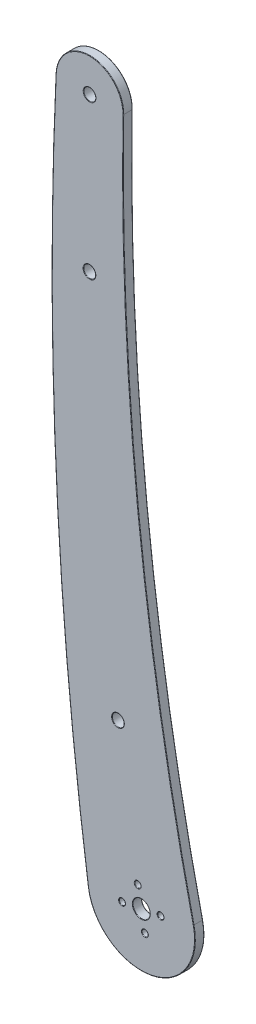
ISO-10303-21;
HEADER;
FILE_DESCRIPTION(('STEP AP214'),'2;1');
FILE_NAME('part.step','',(''),(''),'','','');
FILE_SCHEMA(('AUTOMOTIVE_DESIGN { 1 0 10303 214 1 1 1 1 }'));
ENDSEC;
DATA;
#1=APPLICATION_CONTEXT('core data for automotive mechanical design processes');
#2=APPLICATION_PROTOCOL_DEFINITION('international standard','automotive_design',2000,#1);
#3=PRODUCT_CONTEXT('',#1,'mechanical');
#4=PRODUCT('Part','Part','',(#3));
#5=PRODUCT_RELATED_PRODUCT_CATEGORY('part','',(#4));
#6=PRODUCT_DEFINITION_FORMATION('','',#4);
#7=PRODUCT_DEFINITION_CONTEXT('part definition',#1,'design');
#8=PRODUCT_DEFINITION('design','',#6,#7);
#9=PRODUCT_DEFINITION_SHAPE('','',#8);
#10=(LENGTH_UNIT() NAMED_UNIT(*) SI_UNIT(.MILLI.,.METRE.));
#11=(NAMED_UNIT(*) PLANE_ANGLE_UNIT() SI_UNIT($,.RADIAN.));
#12=(NAMED_UNIT(*) SI_UNIT($,.STERADIAN.) SOLID_ANGLE_UNIT());
#13=UNCERTAINTY_MEASURE_WITH_UNIT(LENGTH_MEASURE(1.E-05),#10,'distance_accuracy_value','');
#14=(GEOMETRIC_REPRESENTATION_CONTEXT(3) GLOBAL_UNCERTAINTY_ASSIGNED_CONTEXT((#13)) GLOBAL_UNIT_ASSIGNED_CONTEXT((#10,
#11,#12)) REPRESENTATION_CONTEXT('',''));
#15=CARTESIAN_POINT('',(0.,0.,0.));
#16=DIRECTION('',(0.,0.,1.));
#17=DIRECTION('',(1.,0.,0.));
#18=AXIS2_PLACEMENT_3D('',#15,#16,#17);
#19=CARTESIAN_POINT('',(-37.0776547455483,278.939028450343,-3.));
#20=DIRECTION('',(0.,0.,1.));
#21=DIRECTION('',(1.,0.,0.));
#22=AXIS2_PLACEMENT_3D('',#19,#20,#21);
#23=CYLINDRICAL_SURFACE('',#22,11.0000000000001);
#24=DIRECTION('',(0.,0.,1.));
#25=VECTOR('',#24,1.);
#26=CARTESIAN_POINT('',(-26.0791673880019,278.756611768298,-3.));
#27=LINE('',#26,#25);
#28=CARTESIAN_POINT('',(-26.0791673880019,278.756611768298,-2.85));
#29=VERTEX_POINT('',#28);
#30=CARTESIAN_POINT('',(-26.0791673880019,278.756611768298,-0.15));
#31=VERTEX_POINT('',#30);
#32=EDGE_CURVE('E108',#29,#31,#27,.T.);
#33=ORIENTED_EDGE('',*,*,#32,.F.);
#34=CARTESIAN_POINT('',(-37.0776547455483,278.939028450343,-2.85));
#35=DIRECTION('',(0.,0.,-1.));
#36=DIRECTION('',(-1.,0.,0.));
#37=AXIS2_PLACEMENT_3D('',#34,#35,#36);
#38=CIRCLE('',#37,11.0000000000001);
#39=CARTESIAN_POINT('',(-48.0655821267615,279.45424866073,-2.85));
#40=VERTEX_POINT('',#39);
#41=EDGE_CURVE('E103',#29,#40,#38,.F.);
#42=ORIENTED_EDGE('',*,*,#41,.T.);
#43=DIRECTION('',(0.,0.,1.));
#44=VECTOR('',#43,1.);
#45=CARTESIAN_POINT('',(-48.0655821267615,279.45424866073,-3.));
#46=LINE('',#45,#44);
#47=CARTESIAN_POINT('',(-48.0655821267615,279.45424866073,-0.15));
#48=VERTEX_POINT('',#47);
#49=EDGE_CURVE('E105',#40,#48,#46,.T.);
#50=ORIENTED_EDGE('',*,*,#49,.T.);
#51=CARTESIAN_POINT('',(-37.0776547455483,278.939028450343,-0.15));
#52=DIRECTION('',(0.,0.,-1.));
#53=DIRECTION('',(-1.,0.,0.));
#54=AXIS2_PLACEMENT_3D('',#51,#52,#53);
#55=CIRCLE('',#54,11.0000000000001);
#56=EDGE_CURVE('E114',#48,#31,#55,.T.);
#57=ORIENTED_EDGE('',*,*,#56,.T.);
#58=EDGE_LOOP('',(#33,#42,#50,#57));
#59=FACE_BOUND('',#58,.T.);
#60=ADVANCED_FACE('F37',(#59),#23,.T.);
#61=CARTESIAN_POINT('',(873.797070956716,263.831610510011,-3.));
#62=DIRECTION('',(0.,0.,1.));
#63=DIRECTION('',(1.,0.,0.));
#64=AXIS2_PLACEMENT_3D('',#61,#62,#63);
#65=CYLINDRICAL_SURFACE('',#64,900.);
#66=DIRECTION('',(0.,0.,1.));
#67=VECTOR('',#66,1.);
#68=CARTESIAN_POINT('',(-3.16790327875482,61.5139544238968,-3.));
#69=LINE('',#68,#67);
#70=CARTESIAN_POINT('',(-3.16790327875482,61.5139544238968,-2.85));
#71=VERTEX_POINT('',#70);
#72=CARTESIAN_POINT('',(-3.16790327875482,61.5139544238968,-0.15));
#73=VERTEX_POINT('',#72);
#74=EDGE_CURVE('E286',#71,#73,#69,.T.);
#75=ORIENTED_EDGE('',*,*,#74,.F.);
#76=CARTESIAN_POINT('',(873.797070956716,263.831610510011,-2.85));
#77=DIRECTION('',(0.,0.,-1.));
#78=DIRECTION('',(-1.,0.,0.));
#79=AXIS2_PLACEMENT_3D('',#76,#77,#78);
#80=CIRCLE('',#79,900.);
#81=EDGE_CURVE('E182',#71,#29,#80,.T.);
#82=ORIENTED_EDGE('',*,*,#81,.T.);
#83=ORIENTED_EDGE('',*,*,#32,.T.);
#84=CARTESIAN_POINT('',(873.797070956716,263.831610510011,-0.15));
#85=DIRECTION('',(0.,0.,-1.));
#86=DIRECTION('',(-1.,0.,0.));
#87=AXIS2_PLACEMENT_3D('',#84,#85,#86);
#88=CIRCLE('',#87,900.);
#89=EDGE_CURVE('E179',#31,#73,#88,.F.);
#90=ORIENTED_EDGE('',*,*,#89,.T.);
#91=EDGE_LOOP('',(#75,#82,#83,#90));
#92=FACE_BOUND('',#91,.T.);
#93=ADVANCED_FACE('F283',(#92),#65,.F.);
#94=CARTESIAN_POINT('',(-20.2199999999997,57.58,-3.));
#95=DIRECTION('',(0.,0.,1.));
#96=DIRECTION('',(1.,0.,0.));
#97=AXIS2_PLACEMENT_3D('',#94,#95,#96);
#98=CYLINDRICAL_SURFACE('',#97,17.4999999999997);
#99=DIRECTION('',(0.,0.,1.));
#100=VECTOR('',#99,1.);
#101=CARTESIAN_POINT('',(-37.5474034553959,55.1282476687248,-3.));
#102=LINE('',#101,#100);
#103=CARTESIAN_POINT('',(-37.5474034553959,55.1282476687248,-2.85));
#104=VERTEX_POINT('',#103);
#105=CARTESIAN_POINT('',(-37.5474034553959,55.1282476687248,-0.15));
#106=VERTEX_POINT('',#105);
#107=EDGE_CURVE('E125',#104,#106,#102,.T.);
#108=ORIENTED_EDGE('',*,*,#107,.F.);
#109=CARTESIAN_POINT('',(-20.2199999999997,57.58,-2.85));
#110=DIRECTION('',(0.,0.,-1.));
#111=DIRECTION('',(-1.,0.,0.));
#112=AXIS2_PLACEMENT_3D('',#109,#110,#111);
#113=CIRCLE('',#112,17.4999999999997);
#114=EDGE_CURVE('E177',#104,#71,#113,.F.);
#115=ORIENTED_EDGE('',*,*,#114,.T.);
#116=ORIENTED_EDGE('',*,*,#74,.T.);
#117=CARTESIAN_POINT('',(-20.2199999999997,57.58,-0.15));
#118=DIRECTION('',(0.,0.,-1.));
#119=DIRECTION('',(-1.,0.,0.));
#120=AXIS2_PLACEMENT_3D('',#117,#118,#119);
#121=CIRCLE('',#120,17.4999999999997);
#122=EDGE_CURVE('E175',#73,#106,#121,.T.);
#123=ORIENTED_EDGE('',*,*,#122,.T.);
#124=EDGE_LOOP('',(#108,#115,#116,#123));
#125=FACE_BOUND('',#124,.T.);
#126=ADVANCED_FACE('F338',(#125),#98,.T.);
#127=CARTESIAN_POINT('',(1150.61740491465,223.248407527602,-3.));
#128=DIRECTION('',(0.,0.,1.));
#129=DIRECTION('',(1.,0.,0.));
#130=AXIS2_PLACEMENT_3D('',#127,#128,#129);
#131=CYLINDRICAL_SURFACE('',#130,1200.);
#132=ORIENTED_EDGE('',*,*,#49,.F.);
#133=CARTESIAN_POINT('',(1150.61740491465,223.248407527602,-2.85));
#134=DIRECTION('',(0.,0.,-1.));
#135=DIRECTION('',(-1.,0.,0.));
#136=AXIS2_PLACEMENT_3D('',#133,#134,#135);
#137=CIRCLE('',#136,1200.);
#138=EDGE_CURVE('E121',#40,#104,#137,.F.);
#139=ORIENTED_EDGE('',*,*,#138,.T.);
#140=ORIENTED_EDGE('',*,*,#107,.T.);
#141=CARTESIAN_POINT('',(1150.61740491465,223.248407527602,-0.15));
#142=DIRECTION('',(0.,0.,-1.));
#143=DIRECTION('',(-1.,0.,0.));
#144=AXIS2_PLACEMENT_3D('',#141,#142,#143);
#145=CIRCLE('',#144,1200.);
#146=EDGE_CURVE('E124',#106,#48,#145,.T.);
#147=ORIENTED_EDGE('',*,*,#146,.T.);
#148=EDGE_LOOP('',(#132,#139,#140,#147));
#149=FACE_BOUND('',#148,.T.);
#150=ADVANCED_FACE('F118',(#149),#131,.T.);
#151=CARTESIAN_POINT('',(418.359708105584,271.385319480177,-3.));
#152=DIRECTION('',(0.,0.,-1.));
#153=DIRECTION('',(-1.,0.,0.));
#154=AXIS2_PLACEMENT_3D('',#151,#152,#153);
#155=PLANE('',#154);
#156=CARTESIAN_POINT('',(-20.2199999999997,57.58,-3.));
#157=DIRECTION('',(0.,0.,-1.));
#158=DIRECTION('',(-1.,0.,0.));
#159=AXIS2_PLACEMENT_3D('',#156,#157,#158);
#160=CIRCLE('',#159,17.3499999999997);
#161=CARTESIAN_POINT('',(-3.31406410779405,61.4802348145491,-3.));
#162=VERTEX_POINT('',#161);
#163=CARTESIAN_POINT('',(-37.3988828543496,55.1492626887071,-3.));
#164=VERTEX_POINT('',#163);
#165=EDGE_CURVE('E171',#162,#164,#160,.T.);
#166=ORIENTED_EDGE('',*,*,#165,.T.);
#167=CARTESIAN_POINT('',(1150.61740491465,223.248407527602,-3.));
#168=DIRECTION('',(0.,0.,-1.));
#169=DIRECTION('',(-1.,0.,0.));
#170=AXIS2_PLACEMENT_3D('',#167,#168,#169);
#171=CIRCLE('',#170,1199.85);
#172=CARTESIAN_POINT('',(-47.9157467533811,279.447222930589,-3.));
#173=VERTEX_POINT('',#172);
#174=EDGE_CURVE('E173',#164,#173,#171,.T.);
#175=ORIENTED_EDGE('',*,*,#174,.T.);
#176=CARTESIAN_POINT('',(-37.0776547455483,278.939028450343,-3.));
#177=DIRECTION('',(0.,0.,-1.));
#178=DIRECTION('',(-1.,0.,0.));
#179=AXIS2_PLACEMENT_3D('',#176,#177,#178);
#180=CIRCLE('',#179,10.8500000000001);
#181=CARTESIAN_POINT('',(-26.2291467610591,278.759099268507,-3.));
#182=VERTEX_POINT('',#181);
#183=EDGE_CURVE('E131',#173,#182,#180,.T.);
#184=ORIENTED_EDGE('',*,*,#183,.T.);
#185=CARTESIAN_POINT('',(873.797070956716,263.831610510011,-3.));
#186=DIRECTION('',(0.,0.,-1.));
#187=DIRECTION('',(-1.,0.,0.));
#188=AXIS2_PLACEMENT_3D('',#185,#186,#187);
#189=CIRCLE('',#188,900.15);
#190=EDGE_CURVE('E169',#182,#162,#189,.F.);
#191=ORIENTED_EDGE('',*,*,#190,.T.);
#192=EDGE_LOOP('',(#166,#175,#184,#191));
#193=FACE_BOUND('',#192,.T.);
#194=CARTESIAN_POINT('',(-20.2199999999997,57.58,-3.));
#195=DIRECTION('',(0.,0.,-1.));
#196=DIRECTION('',(-1.,0.,0.));
#197=AXIS2_PLACEMENT_3D('',#194,#195,#196);
#198=CIRCLE('',#197,2.95);
#199=CARTESIAN_POINT('',(-23.1699999999997,57.58,-3.));
#200=VERTEX_POINT('',#199);
#201=EDGE_CURVE('E165',#200,#200,#198,.F.);
#202=ORIENTED_EDGE('',*,*,#201,.T.);
#203=EDGE_LOOP('',(#202));
#204=FACE_BOUND('',#203,.T.);
#205=CARTESIAN_POINT('',(-37.0776547455483,278.939028450343,-3.));
#206=DIRECTION('',(0.,0.,-1.));
#207=DIRECTION('',(-1.,0.,0.));
#208=AXIS2_PLACEMENT_3D('',#205,#206,#207);
#209=CIRCLE('',#208,2.09999999999999);
#210=CARTESIAN_POINT('',(-39.1776547455483,278.939028450343,-3.));
#211=VERTEX_POINT('',#210);
#212=EDGE_CURVE('E162',#211,#211,#209,.F.);
#213=ORIENTED_EDGE('',*,*,#212,.T.);
#214=EDGE_LOOP('',(#213));
#215=FACE_BOUND('',#214,.T.);
#216=CARTESIAN_POINT('',(-27.8210123611365,106.998868978214,-3.));
#217=DIRECTION('',(0.,0.,-1.));
#218=DIRECTION('',(-1.,0.,0.));
#219=AXIS2_PLACEMENT_3D('',#216,#217,#218);
#220=CIRCLE('',#219,2.1);
#221=CARTESIAN_POINT('',(-29.9210123611365,106.998868978214,-3.));
#222=VERTEX_POINT('',#221);
#223=EDGE_CURVE('E159',#222,#222,#220,.F.);
#224=ORIENTED_EDGE('',*,*,#223,.T.);
#225=EDGE_LOOP('',(#224));
#226=FACE_BOUND('',#225,.T.);
#227=CARTESIAN_POINT('',(-37.1073977935269,228.939037296833,-3.));
#228=DIRECTION('',(0.,0.,-1.));
#229=DIRECTION('',(-1.,0.,0.));
#230=AXIS2_PLACEMENT_3D('',#227,#228,#229);
#231=CIRCLE('',#230,2.1);
#232=CARTESIAN_POINT('',(-39.2073977935269,228.939037296833,-3.));
#233=VERTEX_POINT('',#232);
#234=EDGE_CURVE('E156',#233,#233,#231,.F.);
#235=ORIENTED_EDGE('',*,*,#234,.T.);
#236=EDGE_LOOP('',(#235));
#237=FACE_BOUND('',#236,.T.);
#238=CARTESIAN_POINT('',(-19.0530694017745,51.2974548963875,-3.));
#239=DIRECTION('',(0.,0.,-1.));
#240=DIRECTION('',(-1.,0.,0.));
#241=AXIS2_PLACEMENT_3D('',#238,#239,#240);
#242=CIRCLE('',#241,1.14999999999999);
#243=CARTESIAN_POINT('',(-20.2030694017745,51.2974548963875,-3.));
#244=VERTEX_POINT('',#243);
#245=EDGE_CURVE('E153',#244,#244,#242,.F.);
#246=ORIENTED_EDGE('',*,*,#245,.T.);
#247=EDGE_LOOP('',(#246));
#248=FACE_BOUND('',#247,.T.);
#249=CARTESIAN_POINT('',(-26.5025451036123,56.4130694017748,-3.));
#250=DIRECTION('',(0.,0.,-1.));
#251=DIRECTION('',(-1.,0.,0.));
#252=AXIS2_PLACEMENT_3D('',#249,#250,#251);
#253=CIRCLE('',#252,1.15);
#254=CARTESIAN_POINT('',(-27.6525451036123,56.4130694017748,-3.));
#255=VERTEX_POINT('',#254);
#256=EDGE_CURVE('E150',#255,#255,#253,.F.);
#257=ORIENTED_EDGE('',*,*,#256,.T.);
#258=EDGE_LOOP('',(#257));
#259=FACE_BOUND('',#258,.T.);
#260=CARTESIAN_POINT('',(-21.3869305982249,63.8625451036125,-3.));
#261=DIRECTION('',(0.,0.,-1.));
#262=DIRECTION('',(-1.,0.,0.));
#263=AXIS2_PLACEMENT_3D('',#260,#261,#262);
#264=CIRCLE('',#263,1.14999999999999);
#265=CARTESIAN_POINT('',(-22.5369305982249,63.8625451036125,-3.));
#266=VERTEX_POINT('',#265);
#267=EDGE_CURVE('E144',#266,#266,#264,.F.);
#268=ORIENTED_EDGE('',*,*,#267,.T.);
#269=EDGE_LOOP('',(#268));
#270=FACE_BOUND('',#269,.T.);
#271=CARTESIAN_POINT('',(-13.9374548963872,58.7469305982252,-3.));
#272=DIRECTION('',(0.,0.,-1.));
#273=DIRECTION('',(-1.,0.,0.));
#274=AXIS2_PLACEMENT_3D('',#271,#272,#273);
#275=CIRCLE('',#274,1.15);
#276=CARTESIAN_POINT('',(-15.0874548963872,58.7469305982252,-3.));
#277=VERTEX_POINT('',#276);
#278=EDGE_CURVE('E141',#277,#277,#275,.F.);
#279=ORIENTED_EDGE('',*,*,#278,.T.);
#280=EDGE_LOOP('',(#279));
#281=FACE_BOUND('',#280,.T.);
#282=ADVANCED_FACE('F295',(#193,#204,#215,#226,#237,#248,#259,#270,#281),#155,.T.);
#283=CARTESIAN_POINT('',(418.359708105584,271.385319480177,0.));
#284=DIRECTION('',(0.,0.,-1.));
#285=DIRECTION('',(-1.,0.,0.));
#286=AXIS2_PLACEMENT_3D('',#283,#284,#285);
#287=PLANE('',#286);
#288=CARTESIAN_POINT('',(-20.2199999999997,57.58,0.));
#289=DIRECTION('',(0.,0.,-1.));
#290=DIRECTION('',(-1.,0.,0.));
#291=AXIS2_PLACEMENT_3D('',#288,#289,#290);
#292=CIRCLE('',#291,17.3499999999997);
#293=CARTESIAN_POINT('',(-37.3988828543499,55.1492626887071,0.));
#294=VERTEX_POINT('',#293);
#295=CARTESIAN_POINT('',(-3.31406410779405,61.4802348145491,0.));
#296=VERTEX_POINT('',#295);
#297=EDGE_CURVE('E46',#294,#296,#292,.F.);
#298=ORIENTED_EDGE('',*,*,#297,.T.);
#299=CARTESIAN_POINT('',(873.797070956716,263.831610510011,0.));
#300=DIRECTION('',(0.,0.,-1.));
#301=DIRECTION('',(-1.,0.,0.));
#302=AXIS2_PLACEMENT_3D('',#299,#300,#301);
#303=CIRCLE('',#302,900.15);
#304=CARTESIAN_POINT('',(-26.2291467610591,278.759099268507,0.));
#305=VERTEX_POINT('',#304);
#306=EDGE_CURVE('E11',#296,#305,#303,.T.);
#307=ORIENTED_EDGE('',*,*,#306,.T.);
#308=CARTESIAN_POINT('',(-37.0776547455483,278.939028450343,0.));
#309=DIRECTION('',(0.,0.,-1.));
#310=DIRECTION('',(-1.,0.,0.));
#311=AXIS2_PLACEMENT_3D('',#308,#309,#310);
#312=CIRCLE('',#311,10.8500000000001);
#313=CARTESIAN_POINT('',(-47.9157467533811,279.447222930589,0.));
#314=VERTEX_POINT('',#313);
#315=EDGE_CURVE('E256',#305,#314,#312,.F.);
#316=ORIENTED_EDGE('',*,*,#315,.T.);
#317=CARTESIAN_POINT('',(1150.61740491465,223.248407527602,0.));
#318=DIRECTION('',(0.,0.,-1.));
#319=DIRECTION('',(-1.,0.,0.));
#320=AXIS2_PLACEMENT_3D('',#317,#318,#319);
#321=CIRCLE('',#320,1199.85);
#322=EDGE_CURVE('E57',#314,#294,#321,.F.);
#323=ORIENTED_EDGE('',*,*,#322,.T.);
#324=EDGE_LOOP('',(#298,#307,#316,#323));
#325=FACE_BOUND('',#324,.T.);
#326=CARTESIAN_POINT('',(-20.2199999999997,57.58,0.));
#327=DIRECTION('',(0.,0.,-1.));
#328=DIRECTION('',(-1.,0.,0.));
#329=AXIS2_PLACEMENT_3D('',#326,#327,#328);
#330=CIRCLE('',#329,2.95);
#331=CARTESIAN_POINT('',(-23.1699999999997,57.58,0.));
#332=VERTEX_POINT('',#331);
#333=EDGE_CURVE('E253',#332,#332,#330,.T.);
#334=ORIENTED_EDGE('',*,*,#333,.T.);
#335=EDGE_LOOP('',(#334));
#336=FACE_BOUND('',#335,.T.);
#337=CARTESIAN_POINT('',(-37.0776547455483,278.939028450343,0.));
#338=DIRECTION('',(0.,0.,-1.));
#339=DIRECTION('',(-1.,0.,0.));
#340=AXIS2_PLACEMENT_3D('',#337,#338,#339);
#341=CIRCLE('',#340,2.09999999999999);
#342=CARTESIAN_POINT('',(-39.1776547455483,278.939028450343,0.));
#343=VERTEX_POINT('',#342);
#344=EDGE_CURVE('E250',#343,#343,#341,.T.);
#345=ORIENTED_EDGE('',*,*,#344,.T.);
#346=EDGE_LOOP('',(#345));
#347=FACE_BOUND('',#346,.T.);
#348=CARTESIAN_POINT('',(-27.8210123611365,106.998868978214,0.));
#349=DIRECTION('',(0.,0.,-1.));
#350=DIRECTION('',(-1.,0.,0.));
#351=AXIS2_PLACEMENT_3D('',#348,#349,#350);
#352=CIRCLE('',#351,2.1);
#353=CARTESIAN_POINT('',(-29.9210123611365,106.998868978214,0.));
#354=VERTEX_POINT('',#353);
#355=EDGE_CURVE('E247',#354,#354,#352,.T.);
#356=ORIENTED_EDGE('',*,*,#355,.T.);
#357=EDGE_LOOP('',(#356));
#358=FACE_BOUND('',#357,.T.);
#359=CARTESIAN_POINT('',(-37.1073977935269,228.939037296833,0.));
#360=DIRECTION('',(0.,0.,-1.));
#361=DIRECTION('',(-1.,0.,0.));
#362=AXIS2_PLACEMENT_3D('',#359,#360,#361);
#363=CIRCLE('',#362,2.1);
#364=CARTESIAN_POINT('',(-39.2073977935269,228.939037296833,0.));
#365=VERTEX_POINT('',#364);
#366=EDGE_CURVE('E244',#365,#365,#363,.T.);
#367=ORIENTED_EDGE('',*,*,#366,.T.);
#368=EDGE_LOOP('',(#367));
#369=FACE_BOUND('',#368,.T.);
#370=CARTESIAN_POINT('',(-19.0530694017745,51.2974548963875,0.));
#371=DIRECTION('',(0.,0.,-1.));
#372=DIRECTION('',(-1.,0.,0.));
#373=AXIS2_PLACEMENT_3D('',#370,#371,#372);
#374=CIRCLE('',#373,1.14999999999999);
#375=CARTESIAN_POINT('',(-20.2030694017745,51.2974548963875,0.));
#376=VERTEX_POINT('',#375);
#377=EDGE_CURVE('E241',#376,#376,#374,.T.);
#378=ORIENTED_EDGE('',*,*,#377,.T.);
#379=EDGE_LOOP('',(#378));
#380=FACE_BOUND('',#379,.T.);
#381=CARTESIAN_POINT('',(-26.5025451036123,56.4130694017748,0.));
#382=DIRECTION('',(0.,0.,-1.));
#383=DIRECTION('',(-1.,0.,0.));
#384=AXIS2_PLACEMENT_3D('',#381,#382,#383);
#385=CIRCLE('',#384,1.15);
#386=CARTESIAN_POINT('',(-27.6525451036123,56.4130694017748,0.));
#387=VERTEX_POINT('',#386);
#388=EDGE_CURVE('E238',#387,#387,#385,.T.);
#389=ORIENTED_EDGE('',*,*,#388,.T.);
#390=EDGE_LOOP('',(#389));
#391=FACE_BOUND('',#390,.T.);
#392=CARTESIAN_POINT('',(-21.3869305982249,63.8625451036125,0.));
#393=DIRECTION('',(0.,0.,-1.));
#394=DIRECTION('',(-1.,0.,0.));
#395=AXIS2_PLACEMENT_3D('',#392,#393,#394);
#396=CIRCLE('',#395,1.14999999999999);
#397=CARTESIAN_POINT('',(-22.5369305982249,63.8625451036125,0.));
#398=VERTEX_POINT('',#397);
#399=EDGE_CURVE('E235',#398,#398,#396,.T.);
#400=ORIENTED_EDGE('',*,*,#399,.T.);
#401=EDGE_LOOP('',(#400));
#402=FACE_BOUND('',#401,.T.);
#403=CARTESIAN_POINT('',(-13.9374548963872,58.7469305982252,0.));
#404=DIRECTION('',(0.,0.,-1.));
#405=DIRECTION('',(-1.,0.,0.));
#406=AXIS2_PLACEMENT_3D('',#403,#404,#405);
#407=CIRCLE('',#406,1.15);
#408=CARTESIAN_POINT('',(-15.0874548963872,58.7469305982252,0.));
#409=VERTEX_POINT('',#408);
#410=EDGE_CURVE('E232',#409,#409,#407,.T.);
#411=ORIENTED_EDGE('',*,*,#410,.T.);
#412=EDGE_LOOP('',(#411));
#413=FACE_BOUND('',#412,.T.);
#414=ADVANCED_FACE('F291',(#325,#336,#347,#358,#369,#380,#391,#402,#413),#287,.F.);
#415=CARTESIAN_POINT('',(-20.2199999999997,57.58,-3.));
#416=DIRECTION('',(0.,0.,1.));
#417=DIRECTION('',(1.,0.,0.));
#418=AXIS2_PLACEMENT_3D('',#415,#416,#417);
#419=CYLINDRICAL_SURFACE('',#418,2.8);
#420=CARTESIAN_POINT('',(-20.2199999999997,57.58,-2.85));
#421=DIRECTION('',(0.,0.,-1.));
#422=DIRECTION('',(-1.,0.,0.));
#423=AXIS2_PLACEMENT_3D('',#420,#421,#422);
#424=CIRCLE('',#423,2.8);
#425=CARTESIAN_POINT('',(-23.0199999999997,57.58,-2.85));
#426=VERTEX_POINT('',#425);
#427=EDGE_CURVE('E187',#426,#426,#424,.T.);
#428=ORIENTED_EDGE('',*,*,#427,.T.);
#429=EDGE_LOOP('',(#428));
#430=FACE_BOUND('',#429,.T.);
#431=CARTESIAN_POINT('',(-20.2199999999997,57.58,-0.15));
#432=DIRECTION('',(0.,0.,-1.));
#433=DIRECTION('',(-1.,0.,0.));
#434=AXIS2_PLACEMENT_3D('',#431,#432,#433);
#435=CIRCLE('',#434,2.8);
#436=CARTESIAN_POINT('',(-23.0199999999997,57.58,-0.15));
#437=VERTEX_POINT('',#436);
#438=EDGE_CURVE('E113',#437,#437,#435,.F.);
#439=ORIENTED_EDGE('',*,*,#438,.T.);
#440=EDGE_LOOP('',(#439));
#441=FACE_BOUND('',#440,.T.);
#442=ADVANCED_FACE('F294',(#430,#441),#419,.F.);
#443=CARTESIAN_POINT('',(-37.0776547455483,278.939028450343,-3.));
#444=DIRECTION('',(0.,0.,1.));
#445=DIRECTION('',(1.,0.,0.));
#446=AXIS2_PLACEMENT_3D('',#443,#444,#445);
#447=CYLINDRICAL_SURFACE('',#446,1.94999999999999);
#448=CARTESIAN_POINT('',(-37.0776547455483,278.939028450343,-2.85));
#449=DIRECTION('',(0.,0.,-1.));
#450=DIRECTION('',(-1.,0.,0.));
#451=AXIS2_PLACEMENT_3D('',#448,#449,#450);
#452=CIRCLE('',#451,1.94999999999999);
#453=CARTESIAN_POINT('',(-39.0276547455483,278.939028450343,-2.85));
#454=VERTEX_POINT('',#453);
#455=EDGE_CURVE('E193',#454,#454,#452,.T.);
#456=ORIENTED_EDGE('',*,*,#455,.T.);
#457=EDGE_LOOP('',(#456));
#458=FACE_BOUND('',#457,.T.);
#459=CARTESIAN_POINT('',(-37.0776547455483,278.939028450343,-0.15));
#460=DIRECTION('',(0.,0.,-1.));
#461=DIRECTION('',(-1.,0.,0.));
#462=AXIS2_PLACEMENT_3D('',#459,#460,#461);
#463=CIRCLE('',#462,1.94999999999999);
#464=CARTESIAN_POINT('',(-39.0276547455483,278.939028450343,-0.15));
#465=VERTEX_POINT('',#464);
#466=EDGE_CURVE('E190',#465,#465,#463,.F.);
#467=ORIENTED_EDGE('',*,*,#466,.T.);
#468=EDGE_LOOP('',(#467));
#469=FACE_BOUND('',#468,.T.);
#470=ADVANCED_FACE('F584',(#458,#469),#447,.F.);
#471=CARTESIAN_POINT('',(-27.8210123611365,106.998868978214,-3.));
#472=DIRECTION('',(0.,0.,1.));
#473=DIRECTION('',(1.,0.,0.));
#474=AXIS2_PLACEMENT_3D('',#471,#472,#473);
#475=CYLINDRICAL_SURFACE('',#474,1.95);
#476=CARTESIAN_POINT('',(-27.8210123611365,106.998868978214,-2.85));
#477=DIRECTION('',(0.,0.,-1.));
#478=DIRECTION('',(-1.,0.,0.));
#479=AXIS2_PLACEMENT_3D('',#476,#477,#478);
#480=CIRCLE('',#479,1.95);
#481=CARTESIAN_POINT('',(-29.7710123611365,106.998868978214,-2.85));
#482=VERTEX_POINT('',#481);
#483=EDGE_CURVE('E199',#482,#482,#480,.T.);
#484=ORIENTED_EDGE('',*,*,#483,.T.);
#485=EDGE_LOOP('',(#484));
#486=FACE_BOUND('',#485,.T.);
#487=CARTESIAN_POINT('',(-27.8210123611365,106.998868978214,-0.15));
#488=DIRECTION('',(0.,0.,-1.));
#489=DIRECTION('',(-1.,0.,0.));
#490=AXIS2_PLACEMENT_3D('',#487,#488,#489);
#491=CIRCLE('',#490,1.95);
#492=CARTESIAN_POINT('',(-29.7710123611365,106.998868978214,-0.15));
#493=VERTEX_POINT('',#492);
#494=EDGE_CURVE('E196',#493,#493,#491,.F.);
#495=ORIENTED_EDGE('',*,*,#494,.T.);
#496=EDGE_LOOP('',(#495));
#497=FACE_BOUND('',#496,.T.);
#498=ADVANCED_FACE('F575',(#486,#497),#475,.F.);
#499=CARTESIAN_POINT('',(-37.1073977935269,228.939037296833,-3.));
#500=DIRECTION('',(0.,0.,1.));
#501=DIRECTION('',(1.,0.,0.));
#502=AXIS2_PLACEMENT_3D('',#499,#500,#501);
#503=CYLINDRICAL_SURFACE('',#502,1.95);
#504=CARTESIAN_POINT('',(-37.1073977935269,228.939037296833,-2.85));
#505=DIRECTION('',(0.,0.,-1.));
#506=DIRECTION('',(-1.,0.,0.));
#507=AXIS2_PLACEMENT_3D('',#504,#505,#506);
#508=CIRCLE('',#507,1.95);
#509=CARTESIAN_POINT('',(-39.0573977935269,228.939037296833,-2.85));
#510=VERTEX_POINT('',#509);
#511=EDGE_CURVE('E205',#510,#510,#508,.T.);
#512=ORIENTED_EDGE('',*,*,#511,.T.);
#513=EDGE_LOOP('',(#512));
#514=FACE_BOUND('',#513,.T.);
#515=CARTESIAN_POINT('',(-37.1073977935269,228.939037296833,-0.15));
#516=DIRECTION('',(0.,0.,-1.));
#517=DIRECTION('',(-1.,0.,0.));
#518=AXIS2_PLACEMENT_3D('',#515,#516,#517);
#519=CIRCLE('',#518,1.95);
#520=CARTESIAN_POINT('',(-39.0573977935269,228.939037296833,-0.15));
#521=VERTEX_POINT('',#520);
#522=EDGE_CURVE('E202',#521,#521,#519,.F.);
#523=ORIENTED_EDGE('',*,*,#522,.T.);
#524=EDGE_LOOP('',(#523));
#525=FACE_BOUND('',#524,.T.);
#526=ADVANCED_FACE('F566',(#514,#525),#503,.F.);
#527=CARTESIAN_POINT('',(-19.0530694017745,51.2974548963875,-3.));
#528=DIRECTION('',(0.,0.,1.));
#529=DIRECTION('',(1.,0.,0.));
#530=AXIS2_PLACEMENT_3D('',#527,#528,#529);
#531=CYLINDRICAL_SURFACE('',#530,0.99999999999999);
#532=CARTESIAN_POINT('',(-19.0530694017745,51.2974548963875,-2.85));
#533=DIRECTION('',(0.,0.,-1.));
#534=DIRECTION('',(-1.,0.,0.));
#535=AXIS2_PLACEMENT_3D('',#532,#533,#534);
#536=CIRCLE('',#535,0.99999999999999);
#537=CARTESIAN_POINT('',(-20.0530694017745,51.2974548963875,-2.85));
#538=VERTEX_POINT('',#537);
#539=EDGE_CURVE('E211',#538,#538,#536,.T.);
#540=ORIENTED_EDGE('',*,*,#539,.T.);
#541=EDGE_LOOP('',(#540));
#542=FACE_BOUND('',#541,.T.);
#543=CARTESIAN_POINT('',(-19.0530694017745,51.2974548963875,-0.15));
#544=DIRECTION('',(0.,0.,-1.));
#545=DIRECTION('',(-1.,0.,0.));
#546=AXIS2_PLACEMENT_3D('',#543,#544,#545);
#547=CIRCLE('',#546,0.99999999999999);
#548=CARTESIAN_POINT('',(-20.0530694017745,51.2974548963875,-0.15));
#549=VERTEX_POINT('',#548);
#550=EDGE_CURVE('E208',#549,#549,#547,.F.);
#551=ORIENTED_EDGE('',*,*,#550,.T.);
#552=EDGE_LOOP('',(#551));
#553=FACE_BOUND('',#552,.T.);
#554=ADVANCED_FACE('F557',(#542,#553),#531,.F.);
#555=CARTESIAN_POINT('',(-26.5025451036123,56.4130694017748,-3.));
#556=DIRECTION('',(0.,0.,1.));
#557=DIRECTION('',(1.,0.,0.));
#558=AXIS2_PLACEMENT_3D('',#555,#556,#557);
#559=CYLINDRICAL_SURFACE('',#558,1.);
#560=CARTESIAN_POINT('',(-26.5025451036123,56.4130694017748,-2.85));
#561=DIRECTION('',(0.,0.,-1.));
#562=DIRECTION('',(-1.,0.,0.));
#563=AXIS2_PLACEMENT_3D('',#560,#561,#562);
#564=CIRCLE('',#563,1.);
#565=CARTESIAN_POINT('',(-27.5025451036123,56.4130694017748,-2.85));
#566=VERTEX_POINT('',#565);
#567=EDGE_CURVE('E217',#566,#566,#564,.T.);
#568=ORIENTED_EDGE('',*,*,#567,.T.);
#569=EDGE_LOOP('',(#568));
#570=FACE_BOUND('',#569,.T.);
#571=CARTESIAN_POINT('',(-26.5025451036123,56.4130694017748,-0.15));
#572=DIRECTION('',(0.,0.,-1.));
#573=DIRECTION('',(-1.,0.,0.));
#574=AXIS2_PLACEMENT_3D('',#571,#572,#573);
#575=CIRCLE('',#574,1.);
#576=CARTESIAN_POINT('',(-27.5025451036123,56.4130694017748,-0.15));
#577=VERTEX_POINT('',#576);
#578=EDGE_CURVE('E214',#577,#577,#575,.F.);
#579=ORIENTED_EDGE('',*,*,#578,.T.);
#580=EDGE_LOOP('',(#579));
#581=FACE_BOUND('',#580,.T.);
#582=ADVANCED_FACE('F330',(#570,#581),#559,.F.);
#583=CARTESIAN_POINT('',(-21.3869305982249,63.8625451036125,-3.));
#584=DIRECTION('',(0.,0.,1.));
#585=DIRECTION('',(1.,0.,0.));
#586=AXIS2_PLACEMENT_3D('',#583,#584,#585);
#587=CYLINDRICAL_SURFACE('',#586,0.99999999999999);
#588=CARTESIAN_POINT('',(-21.3869305982249,63.8625451036125,-2.85));
#589=DIRECTION('',(0.,0.,-1.));
#590=DIRECTION('',(-1.,0.,0.));
#591=AXIS2_PLACEMENT_3D('',#588,#589,#590);
#592=CIRCLE('',#591,0.99999999999999);
#593=CARTESIAN_POINT('',(-22.3869305982249,63.8625451036125,-2.85));
#594=VERTEX_POINT('',#593);
#595=EDGE_CURVE('E223',#594,#594,#592,.T.);
#596=ORIENTED_EDGE('',*,*,#595,.T.);
#597=EDGE_LOOP('',(#596));
#598=FACE_BOUND('',#597,.T.);
#599=CARTESIAN_POINT('',(-21.3869305982249,63.8625451036125,-0.15));
#600=DIRECTION('',(0.,0.,-1.));
#601=DIRECTION('',(-1.,0.,0.));
#602=AXIS2_PLACEMENT_3D('',#599,#600,#601);
#603=CIRCLE('',#602,0.99999999999999);
#604=CARTESIAN_POINT('',(-22.3869305982249,63.8625451036125,-0.15));
#605=VERTEX_POINT('',#604);
#606=EDGE_CURVE('E220',#605,#605,#603,.F.);
#607=ORIENTED_EDGE('',*,*,#606,.T.);
#608=EDGE_LOOP('',(#607));
#609=FACE_BOUND('',#608,.T.);
#610=ADVANCED_FACE('F321',(#598,#609),#587,.F.);
#611=CARTESIAN_POINT('',(-13.9374548963872,58.7469305982252,-3.));
#612=DIRECTION('',(0.,0.,1.));
#613=DIRECTION('',(1.,0.,0.));
#614=AXIS2_PLACEMENT_3D('',#611,#612,#613);
#615=CYLINDRICAL_SURFACE('',#614,1.);
#616=CARTESIAN_POINT('',(-13.9374548963872,58.7469305982252,-2.85));
#617=DIRECTION('',(0.,0.,-1.));
#618=DIRECTION('',(-1.,0.,0.));
#619=AXIS2_PLACEMENT_3D('',#616,#617,#618);
#620=CIRCLE('',#619,1.);
#621=CARTESIAN_POINT('',(-14.9374548963872,58.7469305982252,-2.85));
#622=VERTEX_POINT('',#621);
#623=EDGE_CURVE('E229',#622,#622,#620,.T.);
#624=ORIENTED_EDGE('',*,*,#623,.T.);
#625=EDGE_LOOP('',(#624));
#626=FACE_BOUND('',#625,.T.);
#627=CARTESIAN_POINT('',(-13.9374548963872,58.7469305982252,-0.15));
#628=DIRECTION('',(0.,0.,-1.));
#629=DIRECTION('',(-1.,0.,0.));
#630=AXIS2_PLACEMENT_3D('',#627,#628,#629);
#631=CIRCLE('',#630,1.);
#632=CARTESIAN_POINT('',(-14.9374548963872,58.7469305982252,-0.15));
#633=VERTEX_POINT('',#632);
#634=EDGE_CURVE('E226',#633,#633,#631,.F.);
#635=ORIENTED_EDGE('',*,*,#634,.T.);
#636=EDGE_LOOP('',(#635));
#637=FACE_BOUND('',#636,.T.);
#638=ADVANCED_FACE('F318',(#626,#637),#615,.F.);
#639=CARTESIAN_POINT('',(873.797070956716,263.831610510011,-2.85));
#640=DIRECTION('',(0.,0.,-1.));
#641=DIRECTION('',(-1.,0.,0.));
#642=AXIS2_PLACEMENT_3D('',#639,#640,#641);
#643=TOROIDAL_SURFACE('',#642,900.15,0.15);
#644=CARTESIAN_POINT('',(-3.31406410779405,61.4802348145491,-2.85));
#645=DIRECTION('',(0.224797395651233,-0.974405526928302,0.));
#646=DIRECTION('',(0.974405526928303,0.224797395651233,0.));
#647=AXIS2_PLACEMENT_3D('',#644,#645,#646);
#648=CIRCLE('',#647,0.15);
#649=EDGE_CURVE('E135',#162,#71,#648,.T.);
#650=ORIENTED_EDGE('',*,*,#649,.F.);
#651=ORIENTED_EDGE('',*,*,#190,.F.);
#652=CARTESIAN_POINT('',(-26.2291467610593,278.759099268507,-2.85));
#653=DIRECTION('',(0.0165833347313496,0.999862487049688,0.));
#654=DIRECTION('',(-0.999862487049688,0.0165833347313496,0.));
#655=AXIS2_PLACEMENT_3D('',#652,#653,#654);
#656=CIRCLE('',#655,0.15);
#657=EDGE_CURVE('E126',#29,#182,#656,.T.);
#658=ORIENTED_EDGE('',*,*,#657,.F.);
#659=ORIENTED_EDGE('',*,*,#81,.F.);
#660=EDGE_LOOP('',(#650,#651,#658,#659));
#661=FACE_BOUND('',#660,.T.);
#662=ADVANCED_FACE('F320',(#661),#643,.T.);
#663=CARTESIAN_POINT('',(-37.0776547455483,278.939028450343,-2.85));
#664=DIRECTION('',(0.,0.,-1.));
#665=DIRECTION('',(-1.,0.,0.));
#666=AXIS2_PLACEMENT_3D('',#663,#664,#665);
#667=TOROIDAL_SURFACE('',#666,10.8500000000001,0.15);
#668=ORIENTED_EDGE('',*,*,#657,.T.);
#669=ORIENTED_EDGE('',*,*,#183,.F.);
#670=CARTESIAN_POINT('',(-47.9157467533811,279.447222930589,-2.85));
#671=DIRECTION('',(-0.0468382009444214,-0.998902489201168,0.));
#672=DIRECTION('',(0.998902489201168,-0.0468382009444214,0.));
#673=AXIS2_PLACEMENT_3D('',#670,#671,#672);
#674=CIRCLE('',#673,0.15);
#675=EDGE_CURVE('E129',#40,#173,#674,.T.);
#676=ORIENTED_EDGE('',*,*,#675,.F.);
#677=ORIENTED_EDGE('',*,*,#41,.F.);
#678=EDGE_LOOP('',(#668,#669,#676,#677));
#679=FACE_BOUND('',#678,.T.);
#680=ADVANCED_FACE('F130',(#679),#667,.T.);
#681=CARTESIAN_POINT('',(-20.2199999999997,57.58,-2.85));
#682=DIRECTION('',(0.,0.,-1.));
#683=DIRECTION('',(-1.,0.,0.));
#684=AXIS2_PLACEMENT_3D('',#681,#682,#683);
#685=TOROIDAL_SURFACE('',#684,17.3499999999997,0.15);
#686=ORIENTED_EDGE('',*,*,#649,.T.);
#687=ORIENTED_EDGE('',*,*,#114,.F.);
#688=CARTESIAN_POINT('',(-37.3988828543496,55.1492626887071,-2.85));
#689=DIRECTION('',(-0.140100133215795,0.990137340308362,0.));
#690=DIRECTION('',(-0.990137340308362,-0.140100133215795,0.));
#691=AXIS2_PLACEMENT_3D('',#688,#689,#690);
#692=CIRCLE('',#691,0.15);
#693=EDGE_CURVE('E136',#164,#104,#692,.T.);
#694=ORIENTED_EDGE('',*,*,#693,.F.);
#695=ORIENTED_EDGE('',*,*,#165,.F.);
#696=EDGE_LOOP('',(#686,#687,#694,#695));
#697=FACE_BOUND('',#696,.T.);
#698=ADVANCED_FACE('F346',(#697),#685,.T.);
#699=CARTESIAN_POINT('',(1150.61740491465,223.248407527602,-2.85));
#700=DIRECTION('',(0.,0.,-1.));
#701=DIRECTION('',(-1.,0.,0.));
#702=AXIS2_PLACEMENT_3D('',#699,#700,#701);
#703=TOROIDAL_SURFACE('',#702,1199.85,0.15);
#704=ORIENTED_EDGE('',*,*,#675,.T.);
#705=ORIENTED_EDGE('',*,*,#174,.F.);
#706=ORIENTED_EDGE('',*,*,#693,.T.);
#707=ORIENTED_EDGE('',*,*,#138,.F.);
#708=EDGE_LOOP('',(#704,#705,#706,#707));
#709=FACE_BOUND('',#708,.T.);
#710=ADVANCED_FACE('F138',(#709),#703,.T.);
#711=CARTESIAN_POINT('',(-20.2199999999997,57.58,-2.85));
#712=DIRECTION('',(0.,0.,-1.));
#713=DIRECTION('',(-1.,0.,0.));
#714=AXIS2_PLACEMENT_3D('',#711,#712,#713);
#715=TOROIDAL_SURFACE('',#714,2.95,0.15);
#716=ORIENTED_EDGE('',*,*,#427,.F.);
#717=EDGE_LOOP('',(#716));
#718=FACE_BOUND('',#717,.T.);
#719=ORIENTED_EDGE('',*,*,#201,.F.);
#720=EDGE_LOOP('',(#719));
#721=FACE_BOUND('',#720,.T.);
#722=ADVANCED_FACE('F345',(#718,#721),#715,.T.);
#723=CARTESIAN_POINT('',(-37.0776547455483,278.939028450343,-2.85));
#724=DIRECTION('',(0.,0.,-1.));
#725=DIRECTION('',(-1.,0.,0.));
#726=AXIS2_PLACEMENT_3D('',#723,#724,#725);
#727=TOROIDAL_SURFACE('',#726,2.09999999999999,0.15);
#728=ORIENTED_EDGE('',*,*,#455,.F.);
#729=EDGE_LOOP('',(#728));
#730=FACE_BOUND('',#729,.T.);
#731=ORIENTED_EDGE('',*,*,#212,.F.);
#732=EDGE_LOOP('',(#731));
#733=FACE_BOUND('',#732,.T.);
#734=ADVANCED_FACE('F354',(#730,#733),#727,.T.);
#735=CARTESIAN_POINT('',(-27.8210123611365,106.998868978214,-2.85));
#736=DIRECTION('',(0.,0.,-1.));
#737=DIRECTION('',(-1.,0.,0.));
#738=AXIS2_PLACEMENT_3D('',#735,#736,#737);
#739=TOROIDAL_SURFACE('',#738,2.1,0.15);
#740=ORIENTED_EDGE('',*,*,#483,.F.);
#741=EDGE_LOOP('',(#740));
#742=FACE_BOUND('',#741,.T.);
#743=ORIENTED_EDGE('',*,*,#223,.F.);
#744=EDGE_LOOP('',(#743));
#745=FACE_BOUND('',#744,.T.);
#746=ADVANCED_FACE('F358',(#742,#745),#739,.T.);
#747=CARTESIAN_POINT('',(-37.1073977935269,228.939037296833,-2.85));
#748=DIRECTION('',(0.,0.,-1.));
#749=DIRECTION('',(-1.,0.,0.));
#750=AXIS2_PLACEMENT_3D('',#747,#748,#749);
#751=TOROIDAL_SURFACE('',#750,2.1,0.15);
#752=ORIENTED_EDGE('',*,*,#511,.F.);
#753=EDGE_LOOP('',(#752));
#754=FACE_BOUND('',#753,.T.);
#755=ORIENTED_EDGE('',*,*,#234,.F.);
#756=EDGE_LOOP('',(#755));
#757=FACE_BOUND('',#756,.T.);
#758=ADVANCED_FACE('F362',(#754,#757),#751,.T.);
#759=CARTESIAN_POINT('',(-19.0530694017745,51.2974548963875,-2.85));
#760=DIRECTION('',(0.,0.,-1.));
#761=DIRECTION('',(-1.,0.,0.));
#762=AXIS2_PLACEMENT_3D('',#759,#760,#761);
#763=TOROIDAL_SURFACE('',#762,1.14999999999999,0.15);
#764=ORIENTED_EDGE('',*,*,#539,.F.);
#765=EDGE_LOOP('',(#764));
#766=FACE_BOUND('',#765,.T.);
#767=ORIENTED_EDGE('',*,*,#245,.F.);
#768=EDGE_LOOP('',(#767));
#769=FACE_BOUND('',#768,.T.);
#770=ADVANCED_FACE('F366',(#766,#769),#763,.T.);
#771=CARTESIAN_POINT('',(-26.5025451036123,56.4130694017748,-2.85));
#772=DIRECTION('',(0.,0.,-1.));
#773=DIRECTION('',(-1.,0.,0.));
#774=AXIS2_PLACEMENT_3D('',#771,#772,#773);
#775=TOROIDAL_SURFACE('',#774,1.15,0.15);
#776=ORIENTED_EDGE('',*,*,#567,.F.);
#777=EDGE_LOOP('',(#776));
#778=FACE_BOUND('',#777,.T.);
#779=ORIENTED_EDGE('',*,*,#256,.F.);
#780=EDGE_LOOP('',(#779));
#781=FACE_BOUND('',#780,.T.);
#782=ADVANCED_FACE('F370',(#778,#781),#775,.T.);
#783=CARTESIAN_POINT('',(-21.3869305982249,63.8625451036125,-2.85));
#784=DIRECTION('',(0.,0.,-1.));
#785=DIRECTION('',(-1.,0.,0.));
#786=AXIS2_PLACEMENT_3D('',#783,#784,#785);
#787=TOROIDAL_SURFACE('',#786,1.14999999999999,0.15);
#788=ORIENTED_EDGE('',*,*,#595,.F.);
#789=EDGE_LOOP('',(#788));
#790=FACE_BOUND('',#789,.T.);
#791=ORIENTED_EDGE('',*,*,#267,.F.);
#792=EDGE_LOOP('',(#791));
#793=FACE_BOUND('',#792,.T.);
#794=ADVANCED_FACE('F374',(#790,#793),#787,.T.);
#795=CARTESIAN_POINT('',(-13.9374548963872,58.7469305982252,-2.85));
#796=DIRECTION('',(0.,0.,-1.));
#797=DIRECTION('',(-1.,0.,0.));
#798=AXIS2_PLACEMENT_3D('',#795,#796,#797);
#799=TOROIDAL_SURFACE('',#798,1.15,0.15);
#800=ORIENTED_EDGE('',*,*,#623,.F.);
#801=EDGE_LOOP('',(#800));
#802=FACE_BOUND('',#801,.T.);
#803=ORIENTED_EDGE('',*,*,#278,.F.);
#804=EDGE_LOOP('',(#803));
#805=FACE_BOUND('',#804,.T.);
#806=ADVANCED_FACE('F378',(#802,#805),#799,.T.);
#807=CARTESIAN_POINT('',(1150.61740491465,223.248407527602,-0.15));
#808=DIRECTION('',(0.,0.,-1.));
#809=DIRECTION('',(-1.,0.,0.));
#810=AXIS2_PLACEMENT_3D('',#807,#808,#809);
#811=TOROIDAL_SURFACE('',#810,1199.85,0.15);
#812=CARTESIAN_POINT('',(-47.9157467533813,279.447222930589,-0.15));
#813=DIRECTION('',(0.0468382009444214,0.998902489201168,0.));
#814=DIRECTION('',(-0.998902489201168,0.0468382009444214,0.));
#815=AXIS2_PLACEMENT_3D('',#812,#813,#814);
#816=CIRCLE('',#815,0.15);
#817=EDGE_CURVE('E267',#48,#314,#816,.T.);
#818=ORIENTED_EDGE('',*,*,#817,.F.);
#819=ORIENTED_EDGE('',*,*,#146,.F.);
#820=CARTESIAN_POINT('',(-37.3988828543499,55.1492626887071,-0.15));
#821=DIRECTION('',(0.140100133215774,-0.990137340308365,0.));
#822=DIRECTION('',(0.990137340308365,0.140100133215774,0.));
#823=AXIS2_PLACEMENT_3D('',#820,#821,#822);
#824=CIRCLE('',#823,0.15);
#825=EDGE_CURVE('E41',#294,#106,#824,.T.);
#826=ORIENTED_EDGE('',*,*,#825,.F.);
#827=ORIENTED_EDGE('',*,*,#322,.F.);
#828=EDGE_LOOP('',(#818,#819,#826,#827));
#829=FACE_BOUND('',#828,.T.);
#830=ADVANCED_FACE('F277',(#829),#811,.T.);
#831=CARTESIAN_POINT('',(-20.2199999999997,57.58,-0.15));
#832=DIRECTION('',(0.,0.,-1.));
#833=DIRECTION('',(-1.,0.,0.));
#834=AXIS2_PLACEMENT_3D('',#831,#832,#833);
#835=TOROIDAL_SURFACE('',#834,17.3499999999997,0.15);
#836=ORIENTED_EDGE('',*,*,#825,.T.);
#837=ORIENTED_EDGE('',*,*,#122,.F.);
#838=CARTESIAN_POINT('',(-3.31406410779405,61.4802348145491,-0.15));
#839=DIRECTION('',(-0.224797395651233,0.974405526928303,0.));
#840=DIRECTION('',(-0.974405526928303,-0.224797395651233,0.));
#841=AXIS2_PLACEMENT_3D('',#838,#839,#840);
#842=CIRCLE('',#841,0.15);
#843=EDGE_CURVE('E266',#296,#73,#842,.T.);
#844=ORIENTED_EDGE('',*,*,#843,.F.);
#845=ORIENTED_EDGE('',*,*,#297,.F.);
#846=EDGE_LOOP('',(#836,#837,#844,#845));
#847=FACE_BOUND('',#846,.T.);
#848=ADVANCED_FACE('F275',(#847),#835,.T.);
#849=CARTESIAN_POINT('',(-37.0776547455483,278.939028450343,-0.15));
#850=DIRECTION('',(0.,0.,-1.));
#851=DIRECTION('',(-1.,0.,0.));
#852=AXIS2_PLACEMENT_3D('',#849,#850,#851);
#853=TOROIDAL_SURFACE('',#852,10.8500000000001,0.15);
#854=ORIENTED_EDGE('',*,*,#817,.T.);
#855=ORIENTED_EDGE('',*,*,#315,.F.);
#856=CARTESIAN_POINT('',(-26.2291467610591,278.759099268507,-0.15));
#857=DIRECTION('',(-0.0165833347313496,-0.999862487049688,0.));
#858=DIRECTION('',(0.999862487049688,-0.0165833347313496,0.));
#859=AXIS2_PLACEMENT_3D('',#856,#857,#858);
#860=CIRCLE('',#859,0.15);
#861=EDGE_CURVE('E264',#31,#305,#860,.T.);
#862=ORIENTED_EDGE('',*,*,#861,.F.);
#863=ORIENTED_EDGE('',*,*,#56,.F.);
#864=EDGE_LOOP('',(#854,#855,#862,#863));
#865=FACE_BOUND('',#864,.T.);
#866=ADVANCED_FACE('F279',(#865),#853,.T.);
#867=CARTESIAN_POINT('',(873.797070956716,263.831610510011,-0.15));
#868=DIRECTION('',(0.,0.,-1.));
#869=DIRECTION('',(-1.,0.,0.));
#870=AXIS2_PLACEMENT_3D('',#867,#868,#869);
#871=TOROIDAL_SURFACE('',#870,900.15,0.15);
#872=ORIENTED_EDGE('',*,*,#843,.T.);
#873=ORIENTED_EDGE('',*,*,#89,.F.);
#874=ORIENTED_EDGE('',*,*,#861,.T.);
#875=ORIENTED_EDGE('',*,*,#306,.F.);
#876=EDGE_LOOP('',(#872,#873,#874,#875));
#877=FACE_BOUND('',#876,.T.);
#878=ADVANCED_FACE('F289',(#877),#871,.T.);
#879=CARTESIAN_POINT('',(-20.2199999999997,57.58,-0.15));
#880=DIRECTION('',(0.,0.,-1.));
#881=DIRECTION('',(-1.,0.,0.));
#882=AXIS2_PLACEMENT_3D('',#879,#880,#881);
#883=TOROIDAL_SURFACE('',#882,2.95,0.15);
#884=ORIENTED_EDGE('',*,*,#333,.F.);
#885=EDGE_LOOP('',(#884));
#886=FACE_BOUND('',#885,.T.);
#887=ORIENTED_EDGE('',*,*,#438,.F.);
#888=EDGE_LOOP('',(#887));
#889=FACE_BOUND('',#888,.T.);
#890=ADVANCED_FACE('F385',(#886,#889),#883,.T.);
#891=CARTESIAN_POINT('',(-37.0776547455483,278.939028450343,-0.15));
#892=DIRECTION('',(0.,0.,-1.));
#893=DIRECTION('',(-1.,0.,0.));
#894=AXIS2_PLACEMENT_3D('',#891,#892,#893);
#895=TOROIDAL_SURFACE('',#894,2.09999999999999,0.15);
#896=ORIENTED_EDGE('',*,*,#344,.F.);
#897=EDGE_LOOP('',(#896));
#898=FACE_BOUND('',#897,.T.);
#899=ORIENTED_EDGE('',*,*,#466,.F.);
#900=EDGE_LOOP('',(#899));
#901=FACE_BOUND('',#900,.T.);
#902=ADVANCED_FACE('F394',(#898,#901),#895,.T.);
#903=CARTESIAN_POINT('',(-27.8210123611365,106.998868978214,-0.15));
#904=DIRECTION('',(0.,0.,-1.));
#905=DIRECTION('',(-1.,0.,0.));
#906=AXIS2_PLACEMENT_3D('',#903,#904,#905);
#907=TOROIDAL_SURFACE('',#906,2.1,0.15);
#908=ORIENTED_EDGE('',*,*,#355,.F.);
#909=EDGE_LOOP('',(#908));
#910=FACE_BOUND('',#909,.T.);
#911=ORIENTED_EDGE('',*,*,#494,.F.);
#912=EDGE_LOOP('',(#911));
#913=FACE_BOUND('',#912,.T.);
#914=ADVANCED_FACE('F398',(#910,#913),#907,.T.);
#915=CARTESIAN_POINT('',(-37.1073977935269,228.939037296833,-0.15));
#916=DIRECTION('',(0.,0.,-1.));
#917=DIRECTION('',(-1.,0.,0.));
#918=AXIS2_PLACEMENT_3D('',#915,#916,#917);
#919=TOROIDAL_SURFACE('',#918,2.1,0.15);
#920=ORIENTED_EDGE('',*,*,#366,.F.);
#921=EDGE_LOOP('',(#920));
#922=FACE_BOUND('',#921,.T.);
#923=ORIENTED_EDGE('',*,*,#522,.F.);
#924=EDGE_LOOP('',(#923));
#925=FACE_BOUND('',#924,.T.);
#926=ADVANCED_FACE('F402',(#922,#925),#919,.T.);
#927=CARTESIAN_POINT('',(-19.0530694017745,51.2974548963875,-0.15));
#928=DIRECTION('',(0.,0.,-1.));
#929=DIRECTION('',(-1.,0.,0.));
#930=AXIS2_PLACEMENT_3D('',#927,#928,#929);
#931=TOROIDAL_SURFACE('',#930,1.14999999999999,0.15);
#932=ORIENTED_EDGE('',*,*,#377,.F.);
#933=EDGE_LOOP('',(#932));
#934=FACE_BOUND('',#933,.T.);
#935=ORIENTED_EDGE('',*,*,#550,.F.);
#936=EDGE_LOOP('',(#935));
#937=FACE_BOUND('',#936,.T.);
#938=ADVANCED_FACE('F406',(#934,#937),#931,.T.);
#939=CARTESIAN_POINT('',(-26.5025451036123,56.4130694017748,-0.15));
#940=DIRECTION('',(0.,0.,-1.));
#941=DIRECTION('',(-1.,0.,0.));
#942=AXIS2_PLACEMENT_3D('',#939,#940,#941);
#943=TOROIDAL_SURFACE('',#942,1.15,0.15);
#944=ORIENTED_EDGE('',*,*,#388,.F.);
#945=EDGE_LOOP('',(#944));
#946=FACE_BOUND('',#945,.T.);
#947=ORIENTED_EDGE('',*,*,#578,.F.);
#948=EDGE_LOOP('',(#947));
#949=FACE_BOUND('',#948,.T.);
#950=ADVANCED_FACE('F410',(#946,#949),#943,.T.);
#951=CARTESIAN_POINT('',(-21.3869305982249,63.8625451036125,-0.15));
#952=DIRECTION('',(0.,0.,-1.));
#953=DIRECTION('',(-1.,0.,0.));
#954=AXIS2_PLACEMENT_3D('',#951,#952,#953);
#955=TOROIDAL_SURFACE('',#954,1.14999999999999,0.15);
#956=ORIENTED_EDGE('',*,*,#399,.F.);
#957=EDGE_LOOP('',(#956));
#958=FACE_BOUND('',#957,.T.);
#959=ORIENTED_EDGE('',*,*,#606,.F.);
#960=EDGE_LOOP('',(#959));
#961=FACE_BOUND('',#960,.T.);
#962=ADVANCED_FACE('F315',(#958,#961),#955,.T.);
#963=CARTESIAN_POINT('',(-13.9374548963872,58.7469305982252,-0.15));
#964=DIRECTION('',(0.,0.,-1.));
#965=DIRECTION('',(-1.,0.,0.));
#966=AXIS2_PLACEMENT_3D('',#963,#964,#965);
#967=TOROIDAL_SURFACE('',#966,1.15,0.15);
#968=ORIENTED_EDGE('',*,*,#410,.F.);
#969=EDGE_LOOP('',(#968));
#970=FACE_BOUND('',#969,.T.);
#971=ORIENTED_EDGE('',*,*,#634,.F.);
#972=EDGE_LOOP('',(#971));
#973=FACE_BOUND('',#972,.T.);
#974=ADVANCED_FACE('F39',(#970,#973),#967,.T.);
#975=CLOSED_SHELL('',(#60,#93,#126,#150,#282,#414,#442,#470,#498,#526,#554,#582,#610,#638,#662,
#680,#698,#710,#722,#734,#746,#758,#770,#782,#794,#806,#830,#848,#866,#878,#890,#902,#914,#926,
#938,#950,#962,#974));
#976=MANIFOLD_SOLID_BREP('B2',#975);
#977=ADVANCED_BREP_SHAPE_REPRESENTATION('',(#18,#976),#14);
#978=SHAPE_DEFINITION_REPRESENTATION(#9,#977);
ENDSEC;
END-ISO-10303-21;
